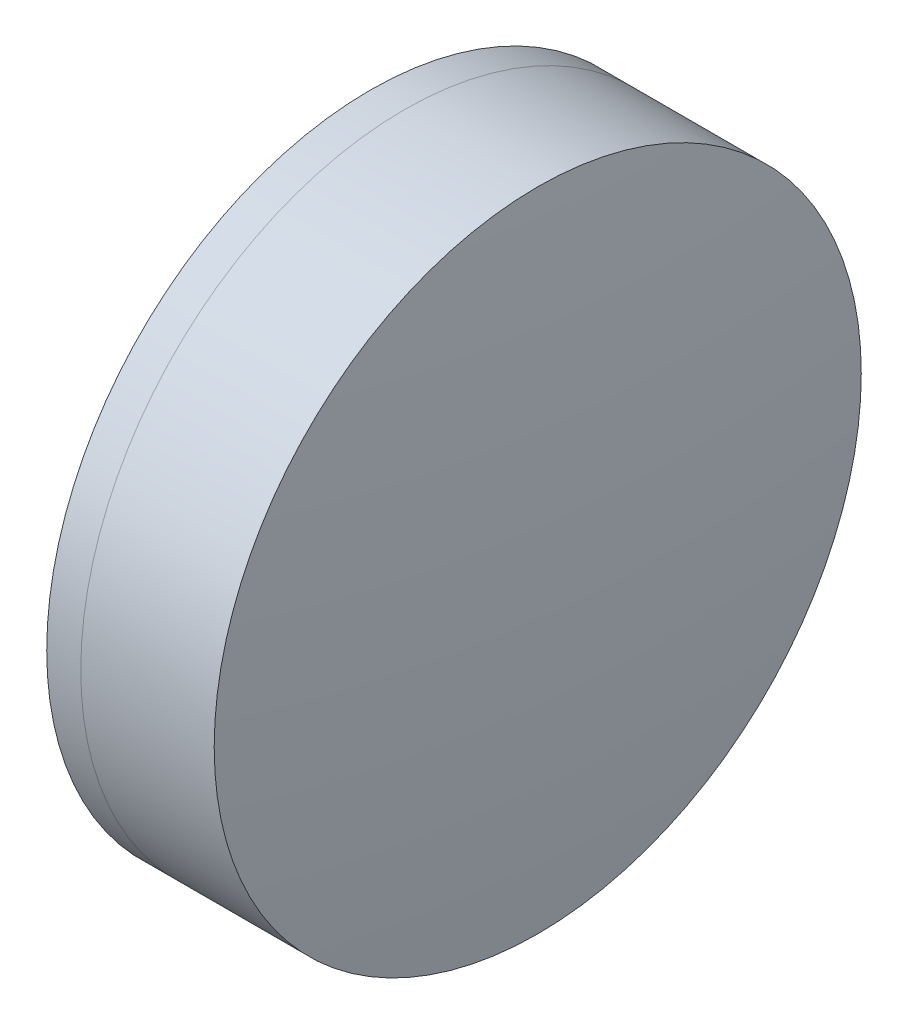
ISO-10303-21;
HEADER;
FILE_DESCRIPTION(('STEP AP214'),'2;1');
FILE_NAME('part.step','',(''),(''),'','','');
FILE_SCHEMA(('AUTOMOTIVE_DESIGN { 1 0 10303 214 1 1 1 1 }'));
ENDSEC;
DATA;
#1=APPLICATION_CONTEXT('core data for automotive mechanical design processes');
#2=APPLICATION_PROTOCOL_DEFINITION('international standard','automotive_design',2000,#1);
#3=PRODUCT_CONTEXT('',#1,'mechanical');
#4=PRODUCT('Part','Part','',(#3));
#5=PRODUCT_RELATED_PRODUCT_CATEGORY('part','',(#4));
#6=PRODUCT_DEFINITION_FORMATION('','',#4);
#7=PRODUCT_DEFINITION_CONTEXT('part definition',#1,'design');
#8=PRODUCT_DEFINITION('design','',#6,#7);
#9=PRODUCT_DEFINITION_SHAPE('','',#8);
#10=(LENGTH_UNIT() NAMED_UNIT(*) SI_UNIT(.MILLI.,.METRE.));
#11=(NAMED_UNIT(*) PLANE_ANGLE_UNIT() SI_UNIT($,.RADIAN.));
#12=(NAMED_UNIT(*) SI_UNIT($,.STERADIAN.) SOLID_ANGLE_UNIT());
#13=UNCERTAINTY_MEASURE_WITH_UNIT(LENGTH_MEASURE(1.E-05),#10,'distance_accuracy_value','');
#14=(GEOMETRIC_REPRESENTATION_CONTEXT(3) GLOBAL_UNCERTAINTY_ASSIGNED_CONTEXT((#13)) GLOBAL_UNIT_ASSIGNED_CONTEXT((#10,
#11,#12)) REPRESENTATION_CONTEXT('',''));
#15=CARTESIAN_POINT('',(0.,0.,0.));
#16=DIRECTION('',(0.,0.,1.));
#17=DIRECTION('',(1.,0.,0.));
#18=AXIS2_PLACEMENT_3D('',#15,#16,#17);
#19=CARTESIAN_POINT('',(61.9520486505755,0.,0.));
#20=DIRECTION('',(-1.,0.,0.));
#21=DIRECTION('',(0.,0.,-1.));
#22=AXIS2_PLACEMENT_3D('',#19,#20,#21);
#23=SPHERICAL_SURFACE('',#22,39.09);
#24=CARTESIAN_POINT('',(91.665145089688,0.,0.));
#25=DIRECTION('',(-1.,0.,0.));
#26=DIRECTION('',(0.,0.,1.));
#27=AXIS2_PLACEMENT_3D('',#24,#25,#26);
#28=CIRCLE('',#27,25.4);
#29=CARTESIAN_POINT('',(91.665145089688,0.,25.4));
#30=VERTEX_POINT('',#29);
#31=EDGE_CURVE('E51',#30,#30,#28,.T.);
#32=ORIENTED_EDGE('',*,*,#31,.T.);
#33=EDGE_LOOP('',(#32));
#34=FACE_BOUND('',#33,.T.);
#35=ADVANCED_FACE('F45',(#34),#23,.F.);
#36=CARTESIAN_POINT('',(-127.157951349425,0.,0.));
#37=DIRECTION('',(-1.,0.,0.));
#38=DIRECTION('',(0.,0.,-1.));
#39=AXIS2_PLACEMENT_3D('',#36,#37,#38);
#40=SPHERICAL_SURFACE('',#39,230.7);
#41=CARTESIAN_POINT('',(102.139519199206,0.,0.));
#42=DIRECTION('',(-1.,0.,0.));
#43=DIRECTION('',(0.,0.,1.));
#44=AXIS2_PLACEMENT_3D('',#41,#42,#43);
#45=CIRCLE('',#44,25.4);
#46=CARTESIAN_POINT('',(102.139519199206,0.,25.4));
#47=VERTEX_POINT('',#46);
#48=EDGE_CURVE('E11',#47,#47,#45,.T.);
#49=ORIENTED_EDGE('',*,*,#48,.F.);
#50=EDGE_LOOP('',(#49));
#51=FACE_BOUND('',#50,.T.);
#52=ADVANCED_FACE('F60',(#51),#40,.T.);
#53=CARTESIAN_POINT('',(-0.551919992657797,0.,0.));
#54=DIRECTION('',(-1.,0.,0.));
#55=DIRECTION('',(0.,0.,1.));
#56=AXIS2_PLACEMENT_3D('',#53,#54,#55);
#57=CYLINDRICAL_SURFACE('',#56,25.4);
#58=ORIENTED_EDGE('',*,*,#48,.T.);
#59=EDGE_LOOP('',(#58));
#60=FACE_BOUND('',#59,.T.);
#61=ORIENTED_EDGE('',*,*,#31,.F.);
#62=EDGE_LOOP('',(#61));
#63=FACE_BOUND('',#62,.T.);
#64=ADVANCED_FACE('F58',(#60,#63),#57,.T.);
#65=CLOSED_SHELL('',(#35,#52,#64));
#66=MANIFOLD_SOLID_BREP('B2',#65);
#67=CARTESIAN_POINT('',(131.932048650575,0.,0.));
#68=DIRECTION('',(-1.,0.,0.));
#69=DIRECTION('',(0.,0.,-1.));
#70=AXIS2_PLACEMENT_3D('',#67,#68,#69);
#71=SPHERICAL_SURFACE('',#70,49.8900000000001);
#72=CARTESIAN_POINT('',(88.9919496753751,0.,0.));
#73=DIRECTION('',(-1.,0.,0.));
#74=DIRECTION('',(0.,0.,1.));
#75=AXIS2_PLACEMENT_3D('',#72,#73,#74);
#76=CIRCLE('',#75,25.4);
#77=CARTESIAN_POINT('',(88.9919496753751,0.,25.4));
#78=VERTEX_POINT('',#77);
#79=EDGE_CURVE('E44',#78,#78,#76,.T.);
#80=ORIENTED_EDGE('',*,*,#79,.T.);
#81=EDGE_LOOP('',(#80));
#82=FACE_BOUND('',#81,.T.);
#83=ADVANCED_FACE('F86',(#82),#71,.T.);
#84=CARTESIAN_POINT('',(-0.816062176165804,0.,0.));
#85=DIRECTION('',(-1.,0.,0.));
#86=DIRECTION('',(0.,0.,1.));
#87=AXIS2_PLACEMENT_3D('',#84,#85,#86);
#88=CYLINDRICAL_SURFACE('',#87,25.4);
#89=CARTESIAN_POINT('',(91.665145089688,0.,0.));
#90=DIRECTION('',(-1.,0.,0.));
#91=DIRECTION('',(0.,0.,1.));
#92=AXIS2_PLACEMENT_3D('',#89,#90,#91);
#93=CIRCLE('',#92,25.4);
#94=CARTESIAN_POINT('',(91.665145089688,0.,25.4));
#95=VERTEX_POINT('',#94);
#96=EDGE_CURVE('E92',#95,#95,#93,.T.);
#97=ORIENTED_EDGE('',*,*,#96,.T.);
#98=EDGE_LOOP('',(#97));
#99=FACE_BOUND('',#98,.T.);
#100=ORIENTED_EDGE('',*,*,#79,.F.);
#101=EDGE_LOOP('',(#100));
#102=FACE_BOUND('',#101,.T.);
#103=ADVANCED_FACE('F98',(#99,#102),#88,.T.);
#104=CARTESIAN_POINT('',(61.9520486505755,0.,0.));
#105=DIRECTION('',(-1.,0.,0.));
#106=DIRECTION('',(0.,0.,1.));
#107=AXIS2_PLACEMENT_3D('',#104,#105,#106);
#108=SPHERICAL_SURFACE('',#107,39.09);
#109=ORIENTED_EDGE('',*,*,#96,.F.);
#110=EDGE_LOOP('',(#109));
#111=FACE_BOUND('',#110,.T.);
#112=ADVANCED_FACE('F101',(#111),#108,.T.);
#113=CLOSED_SHELL('',(#83,#103,#112));
#114=MANIFOLD_SOLID_BREP('B6',#113);
#115=ADVANCED_BREP_SHAPE_REPRESENTATION('',(#18,#66,#114),#14);
#116=SHAPE_DEFINITION_REPRESENTATION(#9,#115);
ENDSEC;
END-ISO-10303-21;
